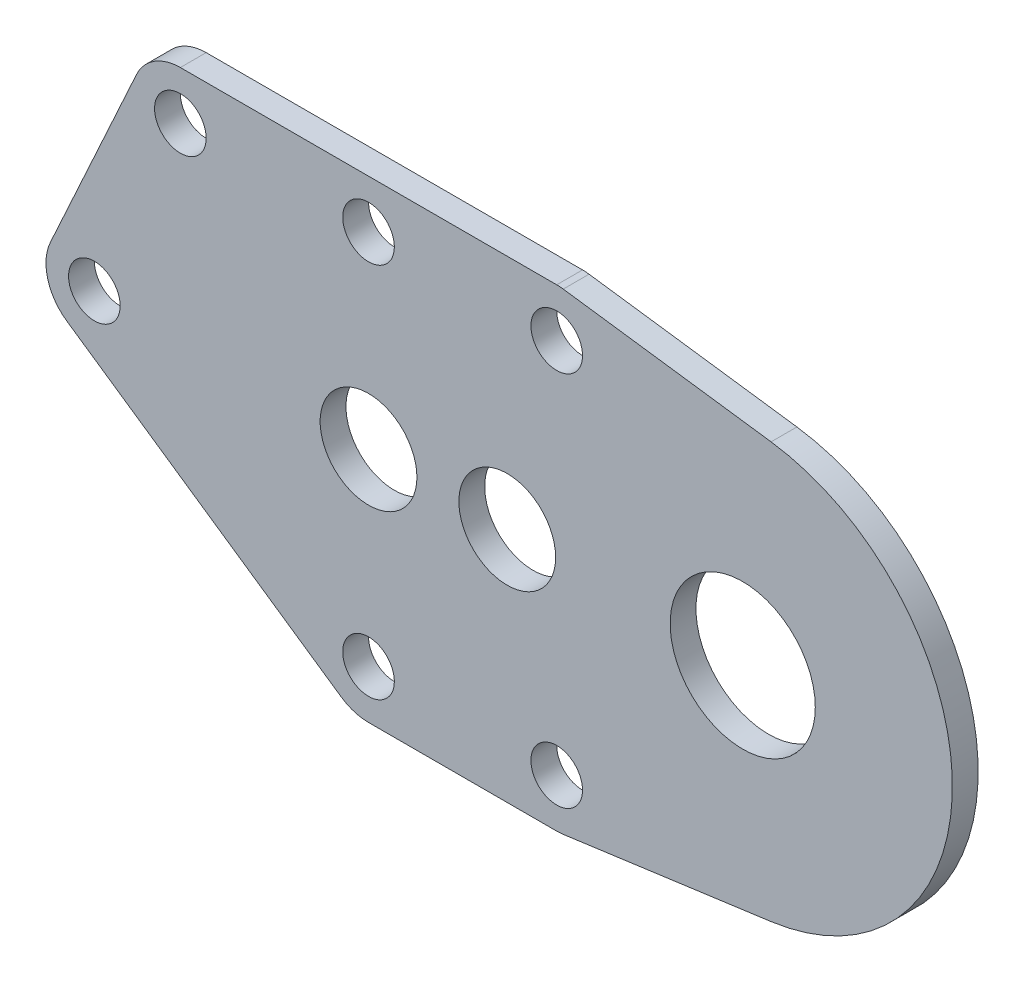
ISO-10303-21;
HEADER;
FILE_DESCRIPTION(('STEP AP214'),'2;1');
FILE_NAME('part.step','',(''),(''),'','','');
FILE_SCHEMA(('AUTOMOTIVE_DESIGN { 1 0 10303 214 1 1 1 1 }'));
ENDSEC;
DATA;
#1=APPLICATION_CONTEXT('core data for automotive mechanical design processes');
#2=APPLICATION_PROTOCOL_DEFINITION('international standard','automotive_design',2000,#1);
#3=PRODUCT_CONTEXT('',#1,'mechanical');
#4=PRODUCT('Part','Part','',(#3));
#5=PRODUCT_RELATED_PRODUCT_CATEGORY('part','',(#4));
#6=PRODUCT_DEFINITION_FORMATION('','',#4);
#7=PRODUCT_DEFINITION_CONTEXT('part definition',#1,'design');
#8=PRODUCT_DEFINITION('design','',#6,#7);
#9=PRODUCT_DEFINITION_SHAPE('','',#8);
#10=(LENGTH_UNIT() NAMED_UNIT(*) SI_UNIT(.MILLI.,.METRE.));
#11=(NAMED_UNIT(*) PLANE_ANGLE_UNIT() SI_UNIT($,.RADIAN.));
#12=(NAMED_UNIT(*) SI_UNIT($,.STERADIAN.) SOLID_ANGLE_UNIT());
#13=UNCERTAINTY_MEASURE_WITH_UNIT(LENGTH_MEASURE(1.E-05),#10,'distance_accuracy_value','');
#14=(GEOMETRIC_REPRESENTATION_CONTEXT(3) GLOBAL_UNCERTAINTY_ASSIGNED_CONTEXT((#13)) GLOBAL_UNIT_ASSIGNED_CONTEXT((#10,
#11,#12)) REPRESENTATION_CONTEXT('',''));
#15=CARTESIAN_POINT('',(0.,0.,0.));
#16=DIRECTION('',(0.,0.,1.));
#17=DIRECTION('',(1.,0.,0.));
#18=AXIS2_PLACEMENT_3D('',#15,#16,#17);
#19=CARTESIAN_POINT('',(11.667261889578,11.667261889578,1.6));
#20=DIRECTION('',(0.,0.,1.));
#21=DIRECTION('',(1.,0.,0.));
#22=AXIS2_PLACEMENT_3D('',#19,#20,#21);
#23=PLANE('',#22);
#24=CARTESIAN_POINT('',(0.,-11.667261889578,1.6));
#25=DIRECTION('',(0.,0.,1.));
#26=DIRECTION('',(1.,0.,0.));
#27=AXIS2_PLACEMENT_3D('',#24,#25,#26);
#28=CIRCLE('',#27,1.6);
#29=CARTESIAN_POINT('',(1.6,-11.667261889578,1.6));
#30=VERTEX_POINT('',#29);
#31=EDGE_CURVE('E311',#30,#30,#28,.T.);
#32=ORIENTED_EDGE('',*,*,#31,.F.);
#33=EDGE_LOOP('',(#32));
#34=FACE_BOUND('',#33,.T.);
#35=CARTESIAN_POINT('',(0.,11.667261889578,1.6));
#36=DIRECTION('',(0.,0.,1.));
#37=DIRECTION('',(1.,0.,0.));
#38=AXIS2_PLACEMENT_3D('',#35,#36,#37);
#39=CIRCLE('',#38,1.6);
#40=CARTESIAN_POINT('',(1.6,11.667261889578,1.6));
#41=VERTEX_POINT('',#40);
#42=EDGE_CURVE('E323',#41,#41,#39,.T.);
#43=ORIENTED_EDGE('',*,*,#42,.F.);
#44=EDGE_LOOP('',(#43));
#45=FACE_BOUND('',#44,.T.);
#46=CARTESIAN_POINT('',(8.6,0.,1.6));
#47=DIRECTION('',(0.,0.,1.));
#48=DIRECTION('',(1.,0.,0.));
#49=AXIS2_PLACEMENT_3D('',#46,#47,#48);
#50=CIRCLE('',#49,3.);
#51=CARTESIAN_POINT('',(11.6,0.,1.6));
#52=VERTEX_POINT('',#51);
#53=EDGE_CURVE('E335',#52,#52,#50,.T.);
#54=ORIENTED_EDGE('',*,*,#53,.F.);
#55=EDGE_LOOP('',(#54));
#56=FACE_BOUND('',#55,.T.);
#57=CARTESIAN_POINT('',(0.,0.,1.6));
#58=DIRECTION('',(0.,0.,1.));
#59=DIRECTION('',(1.,0.,0.));
#60=AXIS2_PLACEMENT_3D('',#57,#58,#59);
#61=CIRCLE('',#60,3.);
#62=CARTESIAN_POINT('',(3.,0.,1.6));
#63=VERTEX_POINT('',#62);
#64=EDGE_CURVE('E347',#63,#63,#61,.T.);
#65=ORIENTED_EDGE('',*,*,#64,.F.);
#66=EDGE_LOOP('',(#65));
#67=FACE_BOUND('',#66,.T.);
#68=CARTESIAN_POINT('',(11.667261889578,11.667261889578,1.6));
#69=DIRECTION('',(0.,0.,1.));
#70=DIRECTION('',(1.,0.,0.));
#71=AXIS2_PLACEMENT_3D('',#68,#69,#70);
#72=CIRCLE('',#71,3.);
#73=CARTESIAN_POINT('',(12.0730700536144,14.6396884629355,1.6));
#74=VERTEX_POINT('',#73);
#75=CARTESIAN_POINT('',(11.667261889578,14.667261889578,1.6));
#76=VERTEX_POINT('',#75);
#77=EDGE_CURVE('E177',#74,#76,#72,.T.);
#78=ORIENTED_EDGE('',*,*,#77,.T.);
#79=DIRECTION('',(-1.,0.,0.));
#80=VECTOR('',#79,1.);
#81=CARTESIAN_POINT('',(11.667261889578,14.667261889578,1.6));
#82=LINE('',#81,#80);
#83=CARTESIAN_POINT('',(-11.667261889578,14.667261889578,1.6));
#84=VERTEX_POINT('',#83);
#85=EDGE_CURVE('E105',#76,#84,#82,.T.);
#86=ORIENTED_EDGE('',*,*,#85,.T.);
#87=CARTESIAN_POINT('',(-11.667261889578,11.667261889578,1.6));
#88=DIRECTION('',(0.,0.,1.));
#89=DIRECTION('',(1.,0.,0.));
#90=AXIS2_PLACEMENT_3D('',#87,#88,#89);
#91=CIRCLE('',#90,3.);
#92=CARTESIAN_POINT('',(-14.3957620066574,12.9143733966607,1.6));
#93=VERTEX_POINT('',#92);
#94=EDGE_CURVE('E204',#84,#93,#91,.T.);
#95=ORIENTED_EDGE('',*,*,#94,.T.);
#96=DIRECTION('',(-0.415703835694222,-0.909500039026448,0.));
#97=VECTOR('',#96,1.);
#98=CARTESIAN_POINT('',(-14.3957620066574,12.9143733966607,1.6));
#99=LINE('',#98,#97);
#100=CARTESIAN_POINT('',(-19.7285001170793,1.24711150708266,1.6));
#101=VERTEX_POINT('',#100);
#102=EDGE_CURVE('E223',#93,#101,#99,.T.);
#103=ORIENTED_EDGE('',*,*,#102,.T.);
#104=CARTESIAN_POINT('',(-17.,0.,1.6));
#105=DIRECTION('',(0.,0.,1.));
#106=DIRECTION('',(1.,0.,0.));
#107=AXIS2_PLACEMENT_3D('',#104,#105,#106);
#108=CIRCLE('',#107,3.);
#109=CARTESIAN_POINT('',(-18.6975863662105,-2.47349965216414,1.6));
#110=VERTEX_POINT('',#109);
#111=EDGE_CURVE('E220',#101,#110,#108,.T.);
#112=ORIENTED_EDGE('',*,*,#111,.T.);
#113=DIRECTION('',(0.824499884054712,-0.565862122070179,0.));
#114=VECTOR('',#113,1.);
#115=CARTESIAN_POINT('',(-18.6975863662105,-2.47349965216414,1.6));
#116=LINE('',#115,#114);
#117=CARTESIAN_POINT('',(-1.69758636621054,-14.1407615417422,1.6));
#118=VERTEX_POINT('',#117);
#119=EDGE_CURVE('E222',#110,#118,#116,.T.);
#120=ORIENTED_EDGE('',*,*,#119,.T.);
#121=CARTESIAN_POINT('',(0.,-11.667261889578,1.6));
#122=DIRECTION('',(0.,0.,1.));
#123=DIRECTION('',(1.,0.,0.));
#124=AXIS2_PLACEMENT_3D('',#121,#122,#123);
#125=CIRCLE('',#124,3.);
#126=CARTESIAN_POINT('',(0.,-14.667261889578,1.6));
#127=VERTEX_POINT('',#126);
#128=EDGE_CURVE('E225',#118,#127,#125,.T.);
#129=ORIENTED_EDGE('',*,*,#128,.T.);
#130=DIRECTION('',(1.,0.,0.));
#131=VECTOR('',#130,1.);
#132=CARTESIAN_POINT('',(11.667261889578,-14.667261889578,1.6));
#133=LINE('',#132,#131);
#134=CARTESIAN_POINT('',(11.667261889578,-14.667261889578,1.6));
#135=VERTEX_POINT('',#134);
#136=EDGE_CURVE('E231',#127,#135,#133,.T.);
#137=ORIENTED_EDGE('',*,*,#136,.T.);
#138=CARTESIAN_POINT('',(11.667261889578,-11.667261889578,1.6));
#139=DIRECTION('',(0.,0.,1.));
#140=DIRECTION('',(1.,0.,0.));
#141=AXIS2_PLACEMENT_3D('',#138,#139,#140);
#142=CIRCLE('',#141,3.);
#143=CARTESIAN_POINT('',(12.0730700536144,-14.6396884629355,1.6));
#144=VERTEX_POINT('',#143);
#145=EDGE_CURVE('E136',#135,#144,#142,.T.);
#146=ORIENTED_EDGE('',*,*,#145,.T.);
#147=DIRECTION('',(0.990808857785813,0.135269388012114,0.));
#148=VECTOR('',#147,1.);
#149=CARTESIAN_POINT('',(12.0730700536144,-14.6396884629355,1.6));
#150=LINE('',#149,#148);
#151=CARTESIAN_POINT('',(24.9585020441575,-12.8805151512156,1.6));
#152=VERTEX_POINT('',#151);
#153=EDGE_CURVE('E130',#144,#152,#150,.T.);
#154=ORIENTED_EDGE('',*,*,#153,.T.);
#155=CARTESIAN_POINT('',(23.2,0.,1.6));
#156=DIRECTION('',(0.,0.,1.));
#157=DIRECTION('',(1.,0.,0.));
#158=AXIS2_PLACEMENT_3D('',#155,#156,#157);
#159=CIRCLE('',#158,13.);
#160=CARTESIAN_POINT('',(24.9585020441575,12.8805151512156,1.6));
#161=VERTEX_POINT('',#160);
#162=EDGE_CURVE('E134',#152,#161,#159,.T.);
#163=ORIENTED_EDGE('',*,*,#162,.T.);
#164=DIRECTION('',(-0.990808857785813,0.135269388012114,0.));
#165=VECTOR('',#164,1.);
#166=CARTESIAN_POINT('',(12.0730700536144,14.6396884629355,1.6));
#167=LINE('',#166,#165);
#168=EDGE_CURVE('E50',#161,#74,#167,.T.);
#169=ORIENTED_EDGE('',*,*,#168,.T.);
#170=EDGE_LOOP('',(#78,#86,#95,#103,#112,#120,#129,#137,#146,#154,#163,#169));
#171=FACE_BOUND('',#170,.T.);
#172=CARTESIAN_POINT('',(-17.,0.,1.6));
#173=DIRECTION('',(0.,0.,1.));
#174=DIRECTION('',(1.,0.,0.));
#175=AXIS2_PLACEMENT_3D('',#172,#173,#174);
#176=CIRCLE('',#175,1.6);
#177=CARTESIAN_POINT('',(-15.4,0.,1.6));
#178=VERTEX_POINT('',#177);
#179=EDGE_CURVE('E158',#178,#178,#176,.T.);
#180=ORIENTED_EDGE('',*,*,#179,.F.);
#181=EDGE_LOOP('',(#180));
#182=FACE_BOUND('',#181,.T.);
#183=CARTESIAN_POINT('',(23.2,0.,1.6));
#184=DIRECTION('',(0.,0.,1.));
#185=DIRECTION('',(1.,0.,0.));
#186=AXIS2_PLACEMENT_3D('',#183,#184,#185);
#187=CIRCLE('',#186,4.5);
#188=CARTESIAN_POINT('',(27.7,0.,1.6));
#189=VERTEX_POINT('',#188);
#190=EDGE_CURVE('E341',#189,#189,#187,.T.);
#191=ORIENTED_EDGE('',*,*,#190,.F.);
#192=EDGE_LOOP('',(#191));
#193=FACE_BOUND('',#192,.T.);
#194=CARTESIAN_POINT('',(-11.667261889578,11.667261889578,1.6));
#195=DIRECTION('',(0.,0.,1.));
#196=DIRECTION('',(1.,0.,0.));
#197=AXIS2_PLACEMENT_3D('',#194,#195,#196);
#198=CIRCLE('',#197,1.6);
#199=CARTESIAN_POINT('',(-10.067261889578,11.667261889578,1.6));
#200=VERTEX_POINT('',#199);
#201=EDGE_CURVE('E329',#200,#200,#198,.T.);
#202=ORIENTED_EDGE('',*,*,#201,.F.);
#203=EDGE_LOOP('',(#202));
#204=FACE_BOUND('',#203,.T.);
#205=CARTESIAN_POINT('',(11.667261889578,11.667261889578,1.6));
#206=DIRECTION('',(0.,0.,1.));
#207=DIRECTION('',(1.,0.,0.));
#208=AXIS2_PLACEMENT_3D('',#205,#206,#207);
#209=CIRCLE('',#208,1.6);
#210=CARTESIAN_POINT('',(13.267261889578,11.667261889578,1.6));
#211=VERTEX_POINT('',#210);
#212=EDGE_CURVE('E317',#211,#211,#209,.T.);
#213=ORIENTED_EDGE('',*,*,#212,.F.);
#214=EDGE_LOOP('',(#213));
#215=FACE_BOUND('',#214,.T.);
#216=CARTESIAN_POINT('',(11.667261889578,-11.667261889578,1.6));
#217=DIRECTION('',(0.,0.,1.));
#218=DIRECTION('',(1.,0.,0.));
#219=AXIS2_PLACEMENT_3D('',#216,#217,#218);
#220=CIRCLE('',#219,1.6);
#221=CARTESIAN_POINT('',(13.267261889578,-11.667261889578,1.6));
#222=VERTEX_POINT('',#221);
#223=EDGE_CURVE('E302',#222,#222,#220,.T.);
#224=ORIENTED_EDGE('',*,*,#223,.F.);
#225=EDGE_LOOP('',(#224));
#226=FACE_BOUND('',#225,.T.);
#227=ADVANCED_FACE('F33',(#34,#45,#56,#67,#171,#182,#193,#204,#215,#226),#23,.T.);
#228=CARTESIAN_POINT('',(11.667261889578,11.667261889578,0.));
#229=DIRECTION('',(0.,0.,1.));
#230=DIRECTION('',(1.,0.,0.));
#231=AXIS2_PLACEMENT_3D('',#228,#229,#230);
#232=PLANE('',#231);
#233=CARTESIAN_POINT('',(11.667261889578,11.667261889578,0.));
#234=DIRECTION('',(0.,0.,1.));
#235=DIRECTION('',(1.,0.,0.));
#236=AXIS2_PLACEMENT_3D('',#233,#234,#235);
#237=CIRCLE('',#236,3.);
#238=CARTESIAN_POINT('',(12.0730700536144,14.6396884629355,0.));
#239=VERTEX_POINT('',#238);
#240=CARTESIAN_POINT('',(11.667261889578,14.667261889578,0.));
#241=VERTEX_POINT('',#240);
#242=EDGE_CURVE('E154',#239,#241,#237,.T.);
#243=ORIENTED_EDGE('',*,*,#242,.F.);
#244=DIRECTION('',(-0.990808857785813,0.135269388012114,0.));
#245=VECTOR('',#244,1.);
#246=CARTESIAN_POINT('',(12.0730700536144,14.6396884629355,0.));
#247=LINE('',#246,#245);
#248=CARTESIAN_POINT('',(24.9585020441575,12.8805151512156,0.));
#249=VERTEX_POINT('',#248);
#250=EDGE_CURVE('E97',#249,#239,#247,.T.);
#251=ORIENTED_EDGE('',*,*,#250,.F.);
#252=CARTESIAN_POINT('',(23.2,0.,0.));
#253=DIRECTION('',(0.,0.,1.));
#254=DIRECTION('',(1.,0.,0.));
#255=AXIS2_PLACEMENT_3D('',#252,#253,#254);
#256=CIRCLE('',#255,13.);
#257=CARTESIAN_POINT('',(24.9585020441575,-12.8805151512156,0.));
#258=VERTEX_POINT('',#257);
#259=EDGE_CURVE('E91',#258,#249,#256,.T.);
#260=ORIENTED_EDGE('',*,*,#259,.F.);
#261=DIRECTION('',(0.990808857785813,0.135269388012114,0.));
#262=VECTOR('',#261,1.);
#263=CARTESIAN_POINT('',(12.0730700536144,-14.6396884629355,0.));
#264=LINE('',#263,#262);
#265=CARTESIAN_POINT('',(12.0730700536144,-14.6396884629355,0.));
#266=VERTEX_POINT('',#265);
#267=EDGE_CURVE('E144',#266,#258,#264,.T.);
#268=ORIENTED_EDGE('',*,*,#267,.F.);
#269=CARTESIAN_POINT('',(11.667261889578,-11.667261889578,0.));
#270=DIRECTION('',(0.,0.,1.));
#271=DIRECTION('',(1.,0.,0.));
#272=AXIS2_PLACEMENT_3D('',#269,#270,#271);
#273=CIRCLE('',#272,3.);
#274=CARTESIAN_POINT('',(11.667261889578,-14.667261889578,0.));
#275=VERTEX_POINT('',#274);
#276=EDGE_CURVE('E172',#275,#266,#273,.T.);
#277=ORIENTED_EDGE('',*,*,#276,.F.);
#278=DIRECTION('',(1.,0.,0.));
#279=VECTOR('',#278,1.);
#280=CARTESIAN_POINT('',(11.667261889578,-14.667261889578,0.));
#281=LINE('',#280,#279);
#282=CARTESIAN_POINT('',(0.,-14.667261889578,0.));
#283=VERTEX_POINT('',#282);
#284=EDGE_CURVE('E170',#283,#275,#281,.T.);
#285=ORIENTED_EDGE('',*,*,#284,.F.);
#286=CARTESIAN_POINT('',(0.,-11.667261889578,0.));
#287=DIRECTION('',(0.,0.,1.));
#288=DIRECTION('',(1.,0.,0.));
#289=AXIS2_PLACEMENT_3D('',#286,#287,#288);
#290=CIRCLE('',#289,3.);
#291=CARTESIAN_POINT('',(-1.69758636621054,-14.1407615417422,0.));
#292=VERTEX_POINT('',#291);
#293=EDGE_CURVE('E168',#292,#283,#290,.T.);
#294=ORIENTED_EDGE('',*,*,#293,.F.);
#295=DIRECTION('',(0.824499884054712,-0.565862122070179,0.));
#296=VECTOR('',#295,1.);
#297=CARTESIAN_POINT('',(-18.6975863662105,-2.47349965216414,0.));
#298=LINE('',#297,#296);
#299=CARTESIAN_POINT('',(-18.6975863662105,-2.47349965216414,0.));
#300=VERTEX_POINT('',#299);
#301=EDGE_CURVE('E166',#300,#292,#298,.T.);
#302=ORIENTED_EDGE('',*,*,#301,.F.);
#303=CARTESIAN_POINT('',(-17.,0.,0.));
#304=DIRECTION('',(0.,0.,1.));
#305=DIRECTION('',(1.,0.,0.));
#306=AXIS2_PLACEMENT_3D('',#303,#304,#305);
#307=CIRCLE('',#306,3.);
#308=CARTESIAN_POINT('',(-19.7285001170793,1.24711150708266,0.));
#309=VERTEX_POINT('',#308);
#310=EDGE_CURVE('E164',#309,#300,#307,.T.);
#311=ORIENTED_EDGE('',*,*,#310,.F.);
#312=DIRECTION('',(-0.415703835694222,-0.909500039026448,0.));
#313=VECTOR('',#312,1.);
#314=CARTESIAN_POINT('',(-14.3957620066574,12.9143733966607,0.));
#315=LINE('',#314,#313);
#316=CARTESIAN_POINT('',(-14.3957620066574,12.9143733966607,0.));
#317=VERTEX_POINT('',#316);
#318=EDGE_CURVE('E162',#317,#309,#315,.T.);
#319=ORIENTED_EDGE('',*,*,#318,.F.);
#320=CARTESIAN_POINT('',(-11.667261889578,11.667261889578,0.));
#321=DIRECTION('',(0.,0.,1.));
#322=DIRECTION('',(1.,0.,0.));
#323=AXIS2_PLACEMENT_3D('',#320,#321,#322);
#324=CIRCLE('',#323,3.);
#325=CARTESIAN_POINT('',(-11.667261889578,14.667261889578,0.));
#326=VERTEX_POINT('',#325);
#327=EDGE_CURVE('E160',#326,#317,#324,.T.);
#328=ORIENTED_EDGE('',*,*,#327,.F.);
#329=DIRECTION('',(-1.,0.,0.));
#330=VECTOR('',#329,1.);
#331=CARTESIAN_POINT('',(11.667261889578,14.667261889578,0.));
#332=LINE('',#331,#330);
#333=EDGE_CURVE('E157',#241,#326,#332,.T.);
#334=ORIENTED_EDGE('',*,*,#333,.F.);
#335=EDGE_LOOP('',(#243,#251,#260,#268,#277,#285,#294,#302,#311,#319,#328,#334));
#336=FACE_BOUND('',#335,.T.);
#337=CARTESIAN_POINT('',(-17.,0.,0.));
#338=DIRECTION('',(0.,0.,1.));
#339=DIRECTION('',(1.,0.,0.));
#340=AXIS2_PLACEMENT_3D('',#337,#338,#339);
#341=CIRCLE('',#340,1.6);
#342=CARTESIAN_POINT('',(-15.4,0.,0.));
#343=VERTEX_POINT('',#342);
#344=EDGE_CURVE('E350',#343,#343,#341,.T.);
#345=ORIENTED_EDGE('',*,*,#344,.T.);
#346=EDGE_LOOP('',(#345));
#347=FACE_BOUND('',#346,.T.);
#348=CARTESIAN_POINT('',(0.,0.,0.));
#349=DIRECTION('',(0.,0.,1.));
#350=DIRECTION('',(1.,0.,0.));
#351=AXIS2_PLACEMENT_3D('',#348,#349,#350);
#352=CIRCLE('',#351,3.);
#353=CARTESIAN_POINT('',(3.,0.,0.));
#354=VERTEX_POINT('',#353);
#355=EDGE_CURVE('E344',#354,#354,#352,.T.);
#356=ORIENTED_EDGE('',*,*,#355,.T.);
#357=EDGE_LOOP('',(#356));
#358=FACE_BOUND('',#357,.T.);
#359=CARTESIAN_POINT('',(23.2,0.,0.));
#360=DIRECTION('',(0.,0.,1.));
#361=DIRECTION('',(1.,0.,0.));
#362=AXIS2_PLACEMENT_3D('',#359,#360,#361);
#363=CIRCLE('',#362,4.5);
#364=CARTESIAN_POINT('',(27.7,0.,0.));
#365=VERTEX_POINT('',#364);
#366=EDGE_CURVE('E338',#365,#365,#363,.T.);
#367=ORIENTED_EDGE('',*,*,#366,.T.);
#368=EDGE_LOOP('',(#367));
#369=FACE_BOUND('',#368,.T.);
#370=CARTESIAN_POINT('',(8.6,0.,0.));
#371=DIRECTION('',(0.,0.,1.));
#372=DIRECTION('',(1.,0.,0.));
#373=AXIS2_PLACEMENT_3D('',#370,#371,#372);
#374=CIRCLE('',#373,3.);
#375=CARTESIAN_POINT('',(11.6,0.,0.));
#376=VERTEX_POINT('',#375);
#377=EDGE_CURVE('E332',#376,#376,#374,.T.);
#378=ORIENTED_EDGE('',*,*,#377,.T.);
#379=EDGE_LOOP('',(#378));
#380=FACE_BOUND('',#379,.T.);
#381=CARTESIAN_POINT('',(-11.667261889578,11.667261889578,0.));
#382=DIRECTION('',(0.,0.,1.));
#383=DIRECTION('',(1.,0.,0.));
#384=AXIS2_PLACEMENT_3D('',#381,#382,#383);
#385=CIRCLE('',#384,1.6);
#386=CARTESIAN_POINT('',(-10.067261889578,11.667261889578,0.));
#387=VERTEX_POINT('',#386);
#388=EDGE_CURVE('E326',#387,#387,#385,.T.);
#389=ORIENTED_EDGE('',*,*,#388,.T.);
#390=EDGE_LOOP('',(#389));
#391=FACE_BOUND('',#390,.T.);
#392=CARTESIAN_POINT('',(0.,11.667261889578,0.));
#393=DIRECTION('',(0.,0.,1.));
#394=DIRECTION('',(1.,0.,0.));
#395=AXIS2_PLACEMENT_3D('',#392,#393,#394);
#396=CIRCLE('',#395,1.6);
#397=CARTESIAN_POINT('',(1.6,11.667261889578,0.));
#398=VERTEX_POINT('',#397);
#399=EDGE_CURVE('E320',#398,#398,#396,.T.);
#400=ORIENTED_EDGE('',*,*,#399,.T.);
#401=EDGE_LOOP('',(#400));
#402=FACE_BOUND('',#401,.T.);
#403=CARTESIAN_POINT('',(11.667261889578,11.667261889578,0.));
#404=DIRECTION('',(0.,0.,1.));
#405=DIRECTION('',(1.,0.,0.));
#406=AXIS2_PLACEMENT_3D('',#403,#404,#405);
#407=CIRCLE('',#406,1.6);
#408=CARTESIAN_POINT('',(13.267261889578,11.667261889578,0.));
#409=VERTEX_POINT('',#408);
#410=EDGE_CURVE('E314',#409,#409,#407,.T.);
#411=ORIENTED_EDGE('',*,*,#410,.T.);
#412=EDGE_LOOP('',(#411));
#413=FACE_BOUND('',#412,.T.);
#414=CARTESIAN_POINT('',(0.,-11.667261889578,0.));
#415=DIRECTION('',(0.,0.,1.));
#416=DIRECTION('',(1.,0.,0.));
#417=AXIS2_PLACEMENT_3D('',#414,#415,#416);
#418=CIRCLE('',#417,1.6);
#419=CARTESIAN_POINT('',(1.6,-11.667261889578,0.));
#420=VERTEX_POINT('',#419);
#421=EDGE_CURVE('E308',#420,#420,#418,.T.);
#422=ORIENTED_EDGE('',*,*,#421,.T.);
#423=EDGE_LOOP('',(#422));
#424=FACE_BOUND('',#423,.T.);
#425=CARTESIAN_POINT('',(11.667261889578,-11.667261889578,0.));
#426=DIRECTION('',(0.,0.,1.));
#427=DIRECTION('',(1.,0.,0.));
#428=AXIS2_PLACEMENT_3D('',#425,#426,#427);
#429=CIRCLE('',#428,1.6);
#430=CARTESIAN_POINT('',(13.267261889578,-11.667261889578,0.));
#431=VERTEX_POINT('',#430);
#432=EDGE_CURVE('E305',#431,#431,#429,.T.);
#433=ORIENTED_EDGE('',*,*,#432,.T.);
#434=EDGE_LOOP('',(#433));
#435=FACE_BOUND('',#434,.T.);
#436=ADVANCED_FACE('F208',(#336,#347,#358,#369,#380,#391,#402,#413,#424,#435),#232,.F.);
#437=CARTESIAN_POINT('',(11.667261889578,11.667261889578,1.6));
#438=DIRECTION('',(0.,0.,-1.));
#439=DIRECTION('',(-1.,0.,0.));
#440=AXIS2_PLACEMENT_3D('',#437,#438,#439);
#441=CYLINDRICAL_SURFACE('',#440,3.);
#442=ORIENTED_EDGE('',*,*,#242,.T.);
#443=DIRECTION('',(0.,0.,-1.));
#444=VECTOR('',#443,1.);
#445=CARTESIAN_POINT('',(11.667261889578,14.667261889578,1.6));
#446=LINE('',#445,#444);
#447=EDGE_CURVE('E11',#76,#241,#446,.T.);
#448=ORIENTED_EDGE('',*,*,#447,.F.);
#449=ORIENTED_EDGE('',*,*,#77,.F.);
#450=DIRECTION('',(0.,0.,-1.));
#451=VECTOR('',#450,1.);
#452=CARTESIAN_POINT('',(12.0730700536144,14.6396884629355,1.6));
#453=LINE('',#452,#451);
#454=EDGE_CURVE('E150',#74,#239,#453,.T.);
#455=ORIENTED_EDGE('',*,*,#454,.T.);
#456=EDGE_LOOP('',(#442,#448,#449,#455));
#457=FACE_BOUND('',#456,.T.);
#458=ADVANCED_FACE('F35',(#457),#441,.T.);
#459=CARTESIAN_POINT('',(11.667261889578,14.667261889578,1.6));
#460=DIRECTION('',(0.,-1.,0.));
#461=DIRECTION('',(0.,0.,-1.));
#462=AXIS2_PLACEMENT_3D('',#459,#460,#461);
#463=PLANE('',#462);
#464=ORIENTED_EDGE('',*,*,#333,.T.);
#465=DIRECTION('',(0.,0.,-1.));
#466=VECTOR('',#465,1.);
#467=CARTESIAN_POINT('',(-11.667261889578,14.667261889578,1.6));
#468=LINE('',#467,#466);
#469=EDGE_CURVE('E42',#84,#326,#468,.T.);
#470=ORIENTED_EDGE('',*,*,#469,.F.);
#471=ORIENTED_EDGE('',*,*,#85,.F.);
#472=ORIENTED_EDGE('',*,*,#447,.T.);
#473=EDGE_LOOP('',(#464,#470,#471,#472));
#474=FACE_BOUND('',#473,.T.);
#475=ADVANCED_FACE('F505',(#474),#463,.F.);
#476=CARTESIAN_POINT('',(-11.667261889578,11.667261889578,1.6));
#477=DIRECTION('',(0.,0.,-1.));
#478=DIRECTION('',(-1.,0.,0.));
#479=AXIS2_PLACEMENT_3D('',#476,#477,#478);
#480=CYLINDRICAL_SURFACE('',#479,3.);
#481=ORIENTED_EDGE('',*,*,#327,.T.);
#482=DIRECTION('',(0.,0.,-1.));
#483=VECTOR('',#482,1.);
#484=CARTESIAN_POINT('',(-14.3957620066574,12.9143733966607,1.6));
#485=LINE('',#484,#483);
#486=EDGE_CURVE('E196',#93,#317,#485,.T.);
#487=ORIENTED_EDGE('',*,*,#486,.F.);
#488=ORIENTED_EDGE('',*,*,#94,.F.);
#489=ORIENTED_EDGE('',*,*,#469,.T.);
#490=EDGE_LOOP('',(#481,#487,#488,#489));
#491=FACE_BOUND('',#490,.T.);
#492=ADVANCED_FACE('F202',(#491),#480,.T.);
#493=CARTESIAN_POINT('',(-14.3957620066574,12.9143733966607,1.6));
#494=DIRECTION('',(0.909500039026448,-0.415703835694222,0.));
#495=DIRECTION('',(0.415703835694222,0.909500039026448,0.));
#496=AXIS2_PLACEMENT_3D('',#493,#494,#495);
#497=PLANE('',#496);
#498=ORIENTED_EDGE('',*,*,#318,.T.);
#499=DIRECTION('',(0.,0.,-1.));
#500=VECTOR('',#499,1.);
#501=CARTESIAN_POINT('',(-19.7285001170793,1.24711150708266,1.6));
#502=LINE('',#501,#500);
#503=EDGE_CURVE('E193',#101,#309,#502,.T.);
#504=ORIENTED_EDGE('',*,*,#503,.F.);
#505=ORIENTED_EDGE('',*,*,#102,.F.);
#506=ORIENTED_EDGE('',*,*,#486,.T.);
#507=EDGE_LOOP('',(#498,#504,#505,#506));
#508=FACE_BOUND('',#507,.T.);
#509=ADVANCED_FACE('F214',(#508),#497,.F.);
#510=CARTESIAN_POINT('',(-17.,0.,1.6));
#511=DIRECTION('',(0.,0.,-1.));
#512=DIRECTION('',(-1.,0.,0.));
#513=AXIS2_PLACEMENT_3D('',#510,#511,#512);
#514=CYLINDRICAL_SURFACE('',#513,3.);
#515=ORIENTED_EDGE('',*,*,#310,.T.);
#516=DIRECTION('',(0.,0.,-1.));
#517=VECTOR('',#516,1.);
#518=CARTESIAN_POINT('',(-18.6975863662105,-2.47349965216414,1.6));
#519=LINE('',#518,#517);
#520=EDGE_CURVE('E190',#110,#300,#519,.T.);
#521=ORIENTED_EDGE('',*,*,#520,.F.);
#522=ORIENTED_EDGE('',*,*,#111,.F.);
#523=ORIENTED_EDGE('',*,*,#503,.T.);
#524=EDGE_LOOP('',(#515,#521,#522,#523));
#525=FACE_BOUND('',#524,.T.);
#526=ADVANCED_FACE('F218',(#525),#514,.T.);
#527=CARTESIAN_POINT('',(-18.6975863662105,-2.47349965216414,1.6));
#528=DIRECTION('',(0.565862122070179,0.824499884054712,0.));
#529=DIRECTION('',(-0.824499884054712,0.565862122070179,0.));
#530=AXIS2_PLACEMENT_3D('',#527,#528,#529);
#531=PLANE('',#530);
#532=ORIENTED_EDGE('',*,*,#301,.T.);
#533=DIRECTION('',(0.,0.,-1.));
#534=VECTOR('',#533,1.);
#535=CARTESIAN_POINT('',(-1.69758636621054,-14.1407615417422,1.6));
#536=LINE('',#535,#534);
#537=EDGE_CURVE('E187',#118,#292,#536,.T.);
#538=ORIENTED_EDGE('',*,*,#537,.F.);
#539=ORIENTED_EDGE('',*,*,#119,.F.);
#540=ORIENTED_EDGE('',*,*,#520,.T.);
#541=EDGE_LOOP('',(#532,#538,#539,#540));
#542=FACE_BOUND('',#541,.T.);
#543=ADVANCED_FACE('F470',(#542),#531,.F.);
#544=CARTESIAN_POINT('',(0.,-11.667261889578,1.6));
#545=DIRECTION('',(0.,0.,-1.));
#546=DIRECTION('',(-1.,0.,0.));
#547=AXIS2_PLACEMENT_3D('',#544,#545,#546);
#548=CYLINDRICAL_SURFACE('',#547,3.);
#549=ORIENTED_EDGE('',*,*,#293,.T.);
#550=DIRECTION('',(0.,0.,-1.));
#551=VECTOR('',#550,1.);
#552=CARTESIAN_POINT('',(0.,-14.667261889578,1.6));
#553=LINE('',#552,#551);
#554=EDGE_CURVE('E184',#127,#283,#553,.T.);
#555=ORIENTED_EDGE('',*,*,#554,.F.);
#556=ORIENTED_EDGE('',*,*,#128,.F.);
#557=ORIENTED_EDGE('',*,*,#537,.T.);
#558=EDGE_LOOP('',(#549,#555,#556,#557));
#559=FACE_BOUND('',#558,.T.);
#560=ADVANCED_FACE('F461',(#559),#548,.T.);
#561=CARTESIAN_POINT('',(11.667261889578,-14.667261889578,1.6));
#562=DIRECTION('',(0.,1.,0.));
#563=DIRECTION('',(-1.,0.,0.));
#564=AXIS2_PLACEMENT_3D('',#561,#562,#563);
#565=PLANE('',#564);
#566=ORIENTED_EDGE('',*,*,#284,.T.);
#567=DIRECTION('',(0.,0.,-1.));
#568=VECTOR('',#567,1.);
#569=CARTESIAN_POINT('',(11.667261889578,-14.667261889578,1.6));
#570=LINE('',#569,#568);
#571=EDGE_CURVE('E181',#135,#275,#570,.T.);
#572=ORIENTED_EDGE('',*,*,#571,.F.);
#573=ORIENTED_EDGE('',*,*,#136,.F.);
#574=ORIENTED_EDGE('',*,*,#554,.T.);
#575=EDGE_LOOP('',(#566,#572,#573,#574));
#576=FACE_BOUND('',#575,.T.);
#577=ADVANCED_FACE('F237',(#576),#565,.F.);
#578=CARTESIAN_POINT('',(11.667261889578,-11.667261889578,1.6));
#579=DIRECTION('',(0.,0.,-1.));
#580=DIRECTION('',(-1.,0.,0.));
#581=AXIS2_PLACEMENT_3D('',#578,#579,#580);
#582=CYLINDRICAL_SURFACE('',#581,3.);
#583=ORIENTED_EDGE('',*,*,#276,.T.);
#584=DIRECTION('',(0.,0.,-1.));
#585=VECTOR('',#584,1.);
#586=CARTESIAN_POINT('',(12.0730700536144,-14.6396884629355,1.6));
#587=LINE('',#586,#585);
#588=EDGE_CURVE('E145',#144,#266,#587,.T.);
#589=ORIENTED_EDGE('',*,*,#588,.F.);
#590=ORIENTED_EDGE('',*,*,#145,.F.);
#591=ORIENTED_EDGE('',*,*,#571,.T.);
#592=EDGE_LOOP('',(#583,#589,#590,#591));
#593=FACE_BOUND('',#592,.T.);
#594=ADVANCED_FACE('F241',(#593),#582,.T.);
#595=CARTESIAN_POINT('',(12.0730700536144,-14.6396884629355,1.6));
#596=DIRECTION('',(-0.135269388012114,0.990808857785813,0.));
#597=DIRECTION('',(-0.990808857785813,-0.135269388012114,0.));
#598=AXIS2_PLACEMENT_3D('',#595,#596,#597);
#599=PLANE('',#598);
#600=ORIENTED_EDGE('',*,*,#267,.T.);
#601=DIRECTION('',(0.,0.,-1.));
#602=VECTOR('',#601,1.);
#603=CARTESIAN_POINT('',(24.9585020441575,-12.8805151512156,1.6));
#604=LINE('',#603,#602);
#605=EDGE_CURVE('E141',#152,#258,#604,.T.);
#606=ORIENTED_EDGE('',*,*,#605,.F.);
#607=ORIENTED_EDGE('',*,*,#153,.F.);
#608=ORIENTED_EDGE('',*,*,#588,.T.);
#609=EDGE_LOOP('',(#600,#606,#607,#608));
#610=FACE_BOUND('',#609,.T.);
#611=ADVANCED_FACE('F142',(#610),#599,.F.);
#612=CARTESIAN_POINT('',(23.2,0.,1.6));
#613=DIRECTION('',(0.,0.,-1.));
#614=DIRECTION('',(-1.,0.,0.));
#615=AXIS2_PLACEMENT_3D('',#612,#613,#614);
#616=CYLINDRICAL_SURFACE('',#615,13.);
#617=ORIENTED_EDGE('',*,*,#259,.T.);
#618=DIRECTION('',(0.,0.,-1.));
#619=VECTOR('',#618,1.);
#620=CARTESIAN_POINT('',(24.9585020441575,12.8805151512156,1.6));
#621=LINE('',#620,#619);
#622=EDGE_CURVE('E146',#161,#249,#621,.T.);
#623=ORIENTED_EDGE('',*,*,#622,.F.);
#624=ORIENTED_EDGE('',*,*,#162,.F.);
#625=ORIENTED_EDGE('',*,*,#605,.T.);
#626=EDGE_LOOP('',(#617,#623,#624,#625));
#627=FACE_BOUND('',#626,.T.);
#628=ADVANCED_FACE('F148',(#627),#616,.T.);
#629=CARTESIAN_POINT('',(12.0730700536144,14.6396884629355,1.6));
#630=DIRECTION('',(-0.135269388012114,-0.990808857785813,0.));
#631=DIRECTION('',(0.990808857785813,-0.135269388012114,0.));
#632=AXIS2_PLACEMENT_3D('',#629,#630,#631);
#633=PLANE('',#632);
#634=ORIENTED_EDGE('',*,*,#250,.T.);
#635=ORIENTED_EDGE('',*,*,#454,.F.);
#636=ORIENTED_EDGE('',*,*,#168,.F.);
#637=ORIENTED_EDGE('',*,*,#622,.T.);
#638=EDGE_LOOP('',(#634,#635,#636,#637));
#639=FACE_BOUND('',#638,.T.);
#640=ADVANCED_FACE('F245',(#639),#633,.F.);
#641=CARTESIAN_POINT('',(-17.,0.,1.6));
#642=DIRECTION('',(0.,0.,-1.));
#643=DIRECTION('',(-1.,0.,0.));
#644=AXIS2_PLACEMENT_3D('',#641,#642,#643);
#645=CYLINDRICAL_SURFACE('',#644,1.6);
#646=ORIENTED_EDGE('',*,*,#179,.T.);
#647=EDGE_LOOP('',(#646));
#648=FACE_BOUND('',#647,.T.);
#649=ORIENTED_EDGE('',*,*,#344,.F.);
#650=EDGE_LOOP('',(#649));
#651=FACE_BOUND('',#650,.T.);
#652=ADVANCED_FACE('F247',(#648,#651),#645,.F.);
#653=CARTESIAN_POINT('',(0.,0.,1.6));
#654=DIRECTION('',(0.,0.,-1.));
#655=DIRECTION('',(-1.,0.,0.));
#656=AXIS2_PLACEMENT_3D('',#653,#654,#655);
#657=CYLINDRICAL_SURFACE('',#656,3.);
#658=ORIENTED_EDGE('',*,*,#64,.T.);
#659=EDGE_LOOP('',(#658));
#660=FACE_BOUND('',#659,.T.);
#661=ORIENTED_EDGE('',*,*,#355,.F.);
#662=EDGE_LOOP('',(#661));
#663=FACE_BOUND('',#662,.T.);
#664=ADVANCED_FACE('F253',(#660,#663),#657,.F.);
#665=CARTESIAN_POINT('',(23.2,0.,1.6));
#666=DIRECTION('',(0.,0.,-1.));
#667=DIRECTION('',(-1.,0.,0.));
#668=AXIS2_PLACEMENT_3D('',#665,#666,#667);
#669=CYLINDRICAL_SURFACE('',#668,4.5);
#670=ORIENTED_EDGE('',*,*,#190,.T.);
#671=EDGE_LOOP('',(#670));
#672=FACE_BOUND('',#671,.T.);
#673=ORIENTED_EDGE('',*,*,#366,.F.);
#674=EDGE_LOOP('',(#673));
#675=FACE_BOUND('',#674,.T.);
#676=ADVANCED_FACE('F269',(#672,#675),#669,.F.);
#677=CARTESIAN_POINT('',(8.6,0.,1.6));
#678=DIRECTION('',(0.,0.,-1.));
#679=DIRECTION('',(-1.,0.,0.));
#680=AXIS2_PLACEMENT_3D('',#677,#678,#679);
#681=CYLINDRICAL_SURFACE('',#680,3.);
#682=ORIENTED_EDGE('',*,*,#53,.T.);
#683=EDGE_LOOP('',(#682));
#684=FACE_BOUND('',#683,.T.);
#685=ORIENTED_EDGE('',*,*,#377,.F.);
#686=EDGE_LOOP('',(#685));
#687=FACE_BOUND('',#686,.T.);
#688=ADVANCED_FACE('F273',(#684,#687),#681,.F.);
#689=CARTESIAN_POINT('',(-11.667261889578,11.667261889578,1.6));
#690=DIRECTION('',(0.,0.,-1.));
#691=DIRECTION('',(-1.,0.,0.));
#692=AXIS2_PLACEMENT_3D('',#689,#690,#691);
#693=CYLINDRICAL_SURFACE('',#692,1.6);
#694=ORIENTED_EDGE('',*,*,#201,.T.);
#695=EDGE_LOOP('',(#694));
#696=FACE_BOUND('',#695,.T.);
#697=ORIENTED_EDGE('',*,*,#388,.F.);
#698=EDGE_LOOP('',(#697));
#699=FACE_BOUND('',#698,.T.);
#700=ADVANCED_FACE('F277',(#696,#699),#693,.F.);
#701=CARTESIAN_POINT('',(0.,11.667261889578,1.6));
#702=DIRECTION('',(0.,0.,-1.));
#703=DIRECTION('',(-1.,0.,0.));
#704=AXIS2_PLACEMENT_3D('',#701,#702,#703);
#705=CYLINDRICAL_SURFACE('',#704,1.6);
#706=ORIENTED_EDGE('',*,*,#42,.T.);
#707=EDGE_LOOP('',(#706));
#708=FACE_BOUND('',#707,.T.);
#709=ORIENTED_EDGE('',*,*,#399,.F.);
#710=EDGE_LOOP('',(#709));
#711=FACE_BOUND('',#710,.T.);
#712=ADVANCED_FACE('F281',(#708,#711),#705,.F.);
#713=CARTESIAN_POINT('',(11.667261889578,11.667261889578,1.6));
#714=DIRECTION('',(0.,0.,-1.));
#715=DIRECTION('',(-1.,0.,0.));
#716=AXIS2_PLACEMENT_3D('',#713,#714,#715);
#717=CYLINDRICAL_SURFACE('',#716,1.6);
#718=ORIENTED_EDGE('',*,*,#212,.T.);
#719=EDGE_LOOP('',(#718));
#720=FACE_BOUND('',#719,.T.);
#721=ORIENTED_EDGE('',*,*,#410,.F.);
#722=EDGE_LOOP('',(#721));
#723=FACE_BOUND('',#722,.T.);
#724=ADVANCED_FACE('F285',(#720,#723),#717,.F.);
#725=CARTESIAN_POINT('',(0.,-11.667261889578,1.6));
#726=DIRECTION('',(0.,0.,-1.));
#727=DIRECTION('',(-1.,0.,0.));
#728=AXIS2_PLACEMENT_3D('',#725,#726,#727);
#729=CYLINDRICAL_SURFACE('',#728,1.6);
#730=ORIENTED_EDGE('',*,*,#31,.T.);
#731=EDGE_LOOP('',(#730));
#732=FACE_BOUND('',#731,.T.);
#733=ORIENTED_EDGE('',*,*,#421,.F.);
#734=EDGE_LOOP('',(#733));
#735=FACE_BOUND('',#734,.T.);
#736=ADVANCED_FACE('F289',(#732,#735),#729,.F.);
#737=CARTESIAN_POINT('',(11.667261889578,-11.667261889578,1.6));
#738=DIRECTION('',(0.,0.,-1.));
#739=DIRECTION('',(-1.,0.,0.));
#740=AXIS2_PLACEMENT_3D('',#737,#738,#739);
#741=CYLINDRICAL_SURFACE('',#740,1.6);
#742=ORIENTED_EDGE('',*,*,#223,.T.);
#743=EDGE_LOOP('',(#742));
#744=FACE_BOUND('',#743,.T.);
#745=ORIENTED_EDGE('',*,*,#432,.F.);
#746=EDGE_LOOP('',(#745));
#747=FACE_BOUND('',#746,.T.);
#748=ADVANCED_FACE('F293',(#744,#747),#741,.F.);
#749=CLOSED_SHELL('',(#227,#436,#458,#475,#492,#509,#526,#543,#560,#577,#594,#611,#628,#640,
#652,#664,#676,#688,#700,#712,#724,#736,#748));
#750=MANIFOLD_SOLID_BREP('B2',#749);
#751=ADVANCED_BREP_SHAPE_REPRESENTATION('',(#18,#750),#14);
#752=SHAPE_DEFINITION_REPRESENTATION(#9,#751);
ENDSEC;
END-ISO-10303-21;
